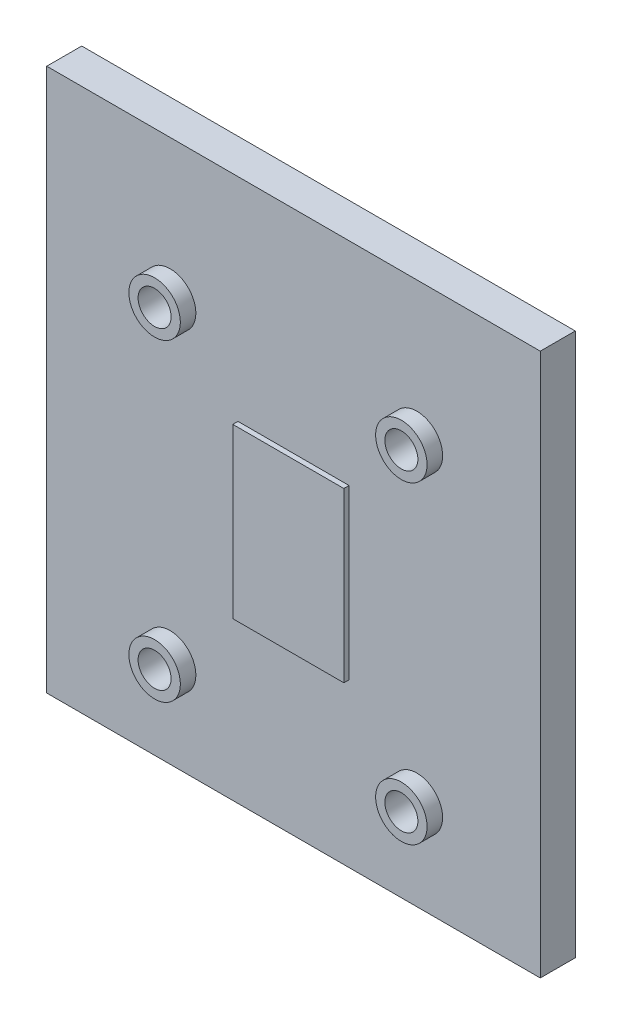
ISO-10303-21;
HEADER;
FILE_DESCRIPTION(('STEP AP214'),'2;1');
FILE_NAME('part.step','',(''),(''),'','','');
FILE_SCHEMA(('AUTOMOTIVE_DESIGN { 1 0 10303 214 1 1 1 1 }'));
ENDSEC;
DATA;
#1=APPLICATION_CONTEXT('core data for automotive mechanical design processes');
#2=APPLICATION_PROTOCOL_DEFINITION('international standard','automotive_design',2000,#1);
#3=PRODUCT_CONTEXT('',#1,'mechanical');
#4=PRODUCT('Part','Part','',(#3));
#5=PRODUCT_RELATED_PRODUCT_CATEGORY('part','',(#4));
#6=PRODUCT_DEFINITION_FORMATION('','',#4);
#7=PRODUCT_DEFINITION_CONTEXT('part definition',#1,'design');
#8=PRODUCT_DEFINITION('design','',#6,#7);
#9=PRODUCT_DEFINITION_SHAPE('','',#8);
#10=(LENGTH_UNIT() NAMED_UNIT(*) SI_UNIT(.MILLI.,.METRE.));
#11=(NAMED_UNIT(*) PLANE_ANGLE_UNIT() SI_UNIT($,.RADIAN.));
#12=(NAMED_UNIT(*) SI_UNIT($,.STERADIAN.) SOLID_ANGLE_UNIT());
#13=UNCERTAINTY_MEASURE_WITH_UNIT(LENGTH_MEASURE(1.E-05),#10,'distance_accuracy_value','');
#14=(GEOMETRIC_REPRESENTATION_CONTEXT(3) GLOBAL_UNCERTAINTY_ASSIGNED_CONTEXT((#13)) GLOBAL_UNIT_ASSIGNED_CONTEXT((#10,
#11,#12)) REPRESENTATION_CONTEXT('',''));
#15=CARTESIAN_POINT('',(0.,0.,0.));
#16=DIRECTION('',(0.,0.,1.));
#17=DIRECTION('',(1.,0.,0.));
#18=AXIS2_PLACEMENT_3D('',#15,#16,#17);
#19=CARTESIAN_POINT('',(-25.4,30.48,-3.6));
#20=DIRECTION('',(-1.,0.,0.));
#21=DIRECTION('',(0.,0.,1.));
#22=AXIS2_PLACEMENT_3D('',#19,#20,#21);
#23=PLANE('',#22);
#24=DIRECTION('',(0.,-1.,0.));
#25=VECTOR('',#24,1.);
#26=CARTESIAN_POINT('',(-25.4,30.48,0.));
#27=LINE('',#26,#25);
#28=CARTESIAN_POINT('',(-25.4,30.48,0.));
#29=VERTEX_POINT('',#28);
#30=CARTESIAN_POINT('',(-25.4,-25.4,0.));
#31=VERTEX_POINT('',#30);
#32=EDGE_CURVE('E122',#29,#31,#27,.T.);
#33=ORIENTED_EDGE('',*,*,#32,.F.);
#34=DIRECTION('',(0.,0.,1.));
#35=VECTOR('',#34,1.);
#36=CARTESIAN_POINT('',(-25.4,30.48,-3.6));
#37=LINE('',#36,#35);
#38=CARTESIAN_POINT('',(-25.4,30.48,-3.6));
#39=VERTEX_POINT('',#38);
#40=EDGE_CURVE('E152',#39,#29,#37,.T.);
#41=ORIENTED_EDGE('',*,*,#40,.F.);
#42=DIRECTION('',(0.,-1.,0.));
#43=VECTOR('',#42,1.);
#44=CARTESIAN_POINT('',(-25.4,30.48,-3.6));
#45=LINE('',#44,#43);
#46=CARTESIAN_POINT('',(-25.4,-25.4,-3.6));
#47=VERTEX_POINT('',#46);
#48=EDGE_CURVE('E131',#39,#47,#45,.T.);
#49=ORIENTED_EDGE('',*,*,#48,.T.);
#50=DIRECTION('',(0.,0.,1.));
#51=VECTOR('',#50,1.);
#52=CARTESIAN_POINT('',(-25.4,-25.4,-3.6));
#53=LINE('',#52,#51);
#54=EDGE_CURVE('E143',#47,#31,#53,.T.);
#55=ORIENTED_EDGE('',*,*,#54,.T.);
#56=EDGE_LOOP('',(#33,#41,#49,#55));
#57=FACE_BOUND('',#56,.T.);
#58=ADVANCED_FACE('F38',(#57),#23,.T.);
#59=CARTESIAN_POINT('',(25.4,30.48,-3.6));
#60=DIRECTION('',(0.,1.,0.));
#61=DIRECTION('',(-1.,0.,0.));
#62=AXIS2_PLACEMENT_3D('',#59,#60,#61);
#63=PLANE('',#62);
#64=DIRECTION('',(-1.,0.,0.));
#65=VECTOR('',#64,1.);
#66=CARTESIAN_POINT('',(25.4,30.48,0.));
#67=LINE('',#66,#65);
#68=CARTESIAN_POINT('',(25.4,30.48,0.));
#69=VERTEX_POINT('',#68);
#70=EDGE_CURVE('E135',#69,#29,#67,.T.);
#71=ORIENTED_EDGE('',*,*,#70,.F.);
#72=DIRECTION('',(0.,0.,1.));
#73=VECTOR('',#72,1.);
#74=CARTESIAN_POINT('',(25.4,30.48,-3.6));
#75=LINE('',#74,#73);
#76=CARTESIAN_POINT('',(25.4,30.48,-3.6));
#77=VERTEX_POINT('',#76);
#78=EDGE_CURVE('E155',#77,#69,#75,.T.);
#79=ORIENTED_EDGE('',*,*,#78,.F.);
#80=DIRECTION('',(-1.,0.,0.));
#81=VECTOR('',#80,1.);
#82=CARTESIAN_POINT('',(25.4,30.48,-3.6));
#83=LINE('',#82,#81);
#84=EDGE_CURVE('E141',#77,#39,#83,.T.);
#85=ORIENTED_EDGE('',*,*,#84,.T.);
#86=ORIENTED_EDGE('',*,*,#40,.T.);
#87=EDGE_LOOP('',(#71,#79,#85,#86));
#88=FACE_BOUND('',#87,.T.);
#89=ADVANCED_FACE('F192',(#88),#63,.T.);
#90=CARTESIAN_POINT('',(25.4,-25.4,-3.6));
#91=DIRECTION('',(1.,0.,0.));
#92=DIRECTION('',(0.,0.,-1.));
#93=AXIS2_PLACEMENT_3D('',#90,#91,#92);
#94=PLANE('',#93);
#95=DIRECTION('',(0.,1.,0.));
#96=VECTOR('',#95,1.);
#97=CARTESIAN_POINT('',(25.4,-25.4,0.));
#98=LINE('',#97,#96);
#99=CARTESIAN_POINT('',(25.4,-25.4,0.));
#100=VERTEX_POINT('',#99);
#101=EDGE_CURVE('E147',#100,#69,#98,.T.);
#102=ORIENTED_EDGE('',*,*,#101,.F.);
#103=DIRECTION('',(0.,0.,1.));
#104=VECTOR('',#103,1.);
#105=CARTESIAN_POINT('',(25.4,-25.4,-3.6));
#106=LINE('',#105,#104);
#107=CARTESIAN_POINT('',(25.4,-25.4,-3.6));
#108=VERTEX_POINT('',#107);
#109=EDGE_CURVE('E157',#108,#100,#106,.T.);
#110=ORIENTED_EDGE('',*,*,#109,.F.);
#111=DIRECTION('',(0.,1.,0.));
#112=VECTOR('',#111,1.);
#113=CARTESIAN_POINT('',(25.4,-25.4,-3.6));
#114=LINE('',#113,#112);
#115=EDGE_CURVE('E138',#108,#77,#114,.T.);
#116=ORIENTED_EDGE('',*,*,#115,.T.);
#117=ORIENTED_EDGE('',*,*,#78,.T.);
#118=EDGE_LOOP('',(#102,#110,#116,#117));
#119=FACE_BOUND('',#118,.T.);
#120=ADVANCED_FACE('F190',(#119),#94,.T.);
#121=CARTESIAN_POINT('',(-25.4,-25.4,-3.6));
#122=DIRECTION('',(0.,-1.,0.));
#123=DIRECTION('',(0.,0.,-1.));
#124=AXIS2_PLACEMENT_3D('',#121,#122,#123);
#125=PLANE('',#124);
#126=DIRECTION('',(1.,0.,0.));
#127=VECTOR('',#126,1.);
#128=CARTESIAN_POINT('',(-25.4,-25.4,0.));
#129=LINE('',#128,#127);
#130=EDGE_CURVE('E125',#31,#100,#129,.T.);
#131=ORIENTED_EDGE('',*,*,#130,.F.);
#132=ORIENTED_EDGE('',*,*,#54,.F.);
#133=DIRECTION('',(1.,0.,0.));
#134=VECTOR('',#133,1.);
#135=CARTESIAN_POINT('',(-25.4,-25.4,-3.6));
#136=LINE('',#135,#134);
#137=EDGE_CURVE('E134',#47,#108,#136,.T.);
#138=ORIENTED_EDGE('',*,*,#137,.T.);
#139=ORIENTED_EDGE('',*,*,#109,.T.);
#140=EDGE_LOOP('',(#131,#132,#138,#139));
#141=FACE_BOUND('',#140,.T.);
#142=ADVANCED_FACE('F186',(#141),#125,.T.);
#143=CARTESIAN_POINT('',(0.,0.,-3.6));
#144=DIRECTION('',(0.,0.,1.));
#145=DIRECTION('',(1.,0.,0.));
#146=AXIS2_PLACEMENT_3D('',#143,#144,#145);
#147=PLANE('',#146);
#148=CARTESIAN_POINT('',(-12.7,-16.129,-3.6));
#149=DIRECTION('',(0.,0.,1.));
#150=DIRECTION('',(1.,0.,0.));
#151=AXIS2_PLACEMENT_3D('',#148,#149,#150);
#152=CIRCLE('',#151,1.69999999999999);
#153=CARTESIAN_POINT('',(-11.,-16.129,-3.6));
#154=VERTEX_POINT('',#153);
#155=EDGE_CURVE('E401',#154,#154,#152,.T.);
#156=ORIENTED_EDGE('',*,*,#155,.T.);
#157=EDGE_LOOP('',(#156));
#158=FACE_BOUND('',#157,.T.);
#159=CARTESIAN_POINT('',(12.7,-16.129,-3.6));
#160=DIRECTION('',(0.,0.,1.));
#161=DIRECTION('',(1.,0.,0.));
#162=AXIS2_PLACEMENT_3D('',#159,#160,#161);
#163=CIRCLE('',#162,1.69999999999999);
#164=CARTESIAN_POINT('',(14.4,-16.129,-3.6));
#165=VERTEX_POINT('',#164);
#166=EDGE_CURVE('E411',#165,#165,#163,.T.);
#167=ORIENTED_EDGE('',*,*,#166,.T.);
#168=EDGE_LOOP('',(#167));
#169=FACE_BOUND('',#168,.T.);
#170=CARTESIAN_POINT('',(12.7,16.129,-3.6));
#171=DIRECTION('',(0.,0.,1.));
#172=DIRECTION('',(1.,0.,0.));
#173=AXIS2_PLACEMENT_3D('',#170,#171,#172);
#174=CIRCLE('',#173,1.69999999999999);
#175=CARTESIAN_POINT('',(14.4,16.129,-3.6));
#176=VERTEX_POINT('',#175);
#177=EDGE_CURVE('E417',#176,#176,#174,.T.);
#178=ORIENTED_EDGE('',*,*,#177,.T.);
#179=EDGE_LOOP('',(#178));
#180=FACE_BOUND('',#179,.T.);
#181=CARTESIAN_POINT('',(-12.7,16.129,-3.6));
#182=DIRECTION('',(0.,0.,1.));
#183=DIRECTION('',(1.,0.,0.));
#184=AXIS2_PLACEMENT_3D('',#181,#182,#183);
#185=CIRCLE('',#184,1.69999999999999);
#186=CARTESIAN_POINT('',(-11.,16.129,-3.6));
#187=VERTEX_POINT('',#186);
#188=EDGE_CURVE('E423',#187,#187,#185,.T.);
#189=ORIENTED_EDGE('',*,*,#188,.T.);
#190=EDGE_LOOP('',(#189));
#191=FACE_BOUND('',#190,.T.);
#192=ORIENTED_EDGE('',*,*,#48,.F.);
#193=ORIENTED_EDGE('',*,*,#84,.F.);
#194=ORIENTED_EDGE('',*,*,#115,.F.);
#195=ORIENTED_EDGE('',*,*,#137,.F.);
#196=EDGE_LOOP('',(#192,#193,#194,#195));
#197=FACE_BOUND('',#196,.T.);
#198=ADVANCED_FACE('F172',(#158,#169,#180,#191,#197),#147,.F.);
#199=CARTESIAN_POINT('',(0.,0.,0.));
#200=DIRECTION('',(0.,0.,1.));
#201=DIRECTION('',(1.,0.,0.));
#202=AXIS2_PLACEMENT_3D('',#199,#200,#201);
#203=PLANE('',#202);
#204=CARTESIAN_POINT('',(12.7,16.129,0.));
#205=DIRECTION('',(0.,0.,1.));
#206=DIRECTION('',(1.,0.,0.));
#207=AXIS2_PLACEMENT_3D('',#204,#205,#206);
#208=CIRCLE('',#207,2.648);
#209=CARTESIAN_POINT('',(15.348,16.129,0.));
#210=VERTEX_POINT('',#209);
#211=EDGE_CURVE('E11',#210,#210,#208,.T.);
#212=ORIENTED_EDGE('',*,*,#211,.F.);
#213=EDGE_LOOP('',(#212));
#214=FACE_BOUND('',#213,.T.);
#215=CARTESIAN_POINT('',(12.7,-16.129,0.));
#216=DIRECTION('',(0.,0.,1.));
#217=DIRECTION('',(1.,0.,0.));
#218=AXIS2_PLACEMENT_3D('',#215,#216,#217);
#219=CIRCLE('',#218,2.648);
#220=CARTESIAN_POINT('',(15.348,-16.129,0.));
#221=VERTEX_POINT('',#220);
#222=EDGE_CURVE('E45',#221,#221,#219,.T.);
#223=ORIENTED_EDGE('',*,*,#222,.F.);
#224=EDGE_LOOP('',(#223));
#225=FACE_BOUND('',#224,.T.);
#226=CARTESIAN_POINT('',(-12.7,-16.129,0.));
#227=DIRECTION('',(0.,0.,1.));
#228=DIRECTION('',(1.,0.,0.));
#229=AXIS2_PLACEMENT_3D('',#226,#227,#228);
#230=CIRCLE('',#229,2.648);
#231=CARTESIAN_POINT('',(-10.052,-16.129,0.));
#232=VERTEX_POINT('',#231);
#233=EDGE_CURVE('E162',#232,#232,#230,.T.);
#234=ORIENTED_EDGE('',*,*,#233,.F.);
#235=EDGE_LOOP('',(#234));
#236=FACE_BOUND('',#235,.T.);
#237=CARTESIAN_POINT('',(-12.7,16.129,0.));
#238=DIRECTION('',(0.,0.,1.));
#239=DIRECTION('',(1.,0.,0.));
#240=AXIS2_PLACEMENT_3D('',#237,#238,#239);
#241=CIRCLE('',#240,2.648);
#242=CARTESIAN_POINT('',(-10.052,16.129,0.));
#243=VERTEX_POINT('',#242);
#244=EDGE_CURVE('E154',#243,#243,#241,.T.);
#245=ORIENTED_EDGE('',*,*,#244,.F.);
#246=EDGE_LOOP('',(#245));
#247=FACE_BOUND('',#246,.T.);
#248=DIRECTION('',(0.,-1.,0.));
#249=VECTOR('',#248,1.);
#250=CARTESIAN_POINT('',(-5.715,-8.6614,0.));
#251=LINE('',#250,#249);
#252=CARTESIAN_POINT('',(-5.715,8.6614,0.));
#253=VERTEX_POINT('',#252);
#254=CARTESIAN_POINT('',(-5.715,-8.6614,0.));
#255=VERTEX_POINT('',#254);
#256=EDGE_CURVE('E52',#253,#255,#251,.T.);
#257=ORIENTED_EDGE('',*,*,#256,.F.);
#258=DIRECTION('',(-1.,0.,0.));
#259=VECTOR('',#258,1.);
#260=CARTESIAN_POINT('',(-5.715,8.6614,0.));
#261=LINE('',#260,#259);
#262=CARTESIAN_POINT('',(5.715,8.6614,0.));
#263=VERTEX_POINT('',#262);
#264=EDGE_CURVE('E56',#263,#253,#261,.T.);
#265=ORIENTED_EDGE('',*,*,#264,.F.);
#266=DIRECTION('',(0.,1.,0.));
#267=VECTOR('',#266,1.);
#268=CARTESIAN_POINT('',(5.715,8.6614,0.));
#269=LINE('',#268,#267);
#270=CARTESIAN_POINT('',(5.715,-8.6614,0.));
#271=VERTEX_POINT('',#270);
#272=EDGE_CURVE('E444',#271,#263,#269,.T.);
#273=ORIENTED_EDGE('',*,*,#272,.F.);
#274=DIRECTION('',(1.,0.,0.));
#275=VECTOR('',#274,1.);
#276=CARTESIAN_POINT('',(5.715,-8.6614,0.));
#277=LINE('',#276,#275);
#278=EDGE_CURVE('E442',#255,#271,#277,.T.);
#279=ORIENTED_EDGE('',*,*,#278,.F.);
#280=EDGE_LOOP('',(#257,#265,#273,#279));
#281=FACE_BOUND('',#280,.T.);
#282=ORIENTED_EDGE('',*,*,#32,.T.);
#283=ORIENTED_EDGE('',*,*,#130,.T.);
#284=ORIENTED_EDGE('',*,*,#101,.T.);
#285=ORIENTED_EDGE('',*,*,#70,.T.);
#286=EDGE_LOOP('',(#282,#283,#284,#285));
#287=FACE_BOUND('',#286,.T.);
#288=ADVANCED_FACE('F169',(#214,#225,#236,#247,#281,#287),#203,.T.);
#289=CARTESIAN_POINT('',(-5.715,-8.6614,0.5332));
#290=DIRECTION('',(1.,0.,0.));
#291=DIRECTION('',(0.,1.,0.));
#292=AXIS2_PLACEMENT_3D('',#289,#290,#291);
#293=PLANE('',#292);
#294=ORIENTED_EDGE('',*,*,#256,.T.);
#295=DIRECTION('',(0.,0.,-1.));
#296=VECTOR('',#295,1.);
#297=CARTESIAN_POINT('',(-5.715,-8.6614,0.5332));
#298=LINE('',#297,#296);
#299=CARTESIAN_POINT('',(-5.715,-8.6614,0.5332));
#300=VERTEX_POINT('',#299);
#301=EDGE_CURVE('E105',#300,#255,#298,.T.);
#302=ORIENTED_EDGE('',*,*,#301,.F.);
#303=DIRECTION('',(0.,-1.,0.));
#304=VECTOR('',#303,1.);
#305=CARTESIAN_POINT('',(-5.715,-8.6614,0.5332));
#306=LINE('',#305,#304);
#307=CARTESIAN_POINT('',(-5.715,8.6614,0.5332));
#308=VERTEX_POINT('',#307);
#309=EDGE_CURVE('E111',#308,#300,#306,.T.);
#310=ORIENTED_EDGE('',*,*,#309,.F.);
#311=DIRECTION('',(0.,0.,-1.));
#312=VECTOR('',#311,1.);
#313=CARTESIAN_POINT('',(-5.715,8.6614,0.5332));
#314=LINE('',#313,#312);
#315=EDGE_CURVE('E440',#308,#253,#314,.T.);
#316=ORIENTED_EDGE('',*,*,#315,.T.);
#317=EDGE_LOOP('',(#294,#302,#310,#316));
#318=FACE_BOUND('',#317,.T.);
#319=ADVANCED_FACE('F121',(#318),#293,.F.);
#320=CARTESIAN_POINT('',(5.715,-8.6614,0.5332));
#321=DIRECTION('',(0.,1.,0.));
#322=DIRECTION('',(0.,0.,1.));
#323=AXIS2_PLACEMENT_3D('',#320,#321,#322);
#324=PLANE('',#323);
#325=ORIENTED_EDGE('',*,*,#278,.T.);
#326=DIRECTION('',(0.,0.,-1.));
#327=VECTOR('',#326,1.);
#328=CARTESIAN_POINT('',(5.715,-8.6614,0.5332));
#329=LINE('',#328,#327);
#330=CARTESIAN_POINT('',(5.715,-8.6614,0.5332));
#331=VERTEX_POINT('',#330);
#332=EDGE_CURVE('E107',#331,#271,#329,.T.);
#333=ORIENTED_EDGE('',*,*,#332,.F.);
#334=DIRECTION('',(1.,0.,0.));
#335=VECTOR('',#334,1.);
#336=CARTESIAN_POINT('',(5.715,-8.6614,0.5332));
#337=LINE('',#336,#335);
#338=EDGE_CURVE('E100',#300,#331,#337,.T.);
#339=ORIENTED_EDGE('',*,*,#338,.F.);
#340=ORIENTED_EDGE('',*,*,#301,.T.);
#341=EDGE_LOOP('',(#325,#333,#339,#340));
#342=FACE_BOUND('',#341,.T.);
#343=ADVANCED_FACE('F103',(#342),#324,.F.);
#344=CARTESIAN_POINT('',(5.715,8.6614,0.5332));
#345=DIRECTION('',(-1.,0.,0.));
#346=DIRECTION('',(0.,-1.,0.));
#347=AXIS2_PLACEMENT_3D('',#344,#345,#346);
#348=PLANE('',#347);
#349=ORIENTED_EDGE('',*,*,#272,.T.);
#350=DIRECTION('',(0.,0.,-1.));
#351=VECTOR('',#350,1.);
#352=CARTESIAN_POINT('',(5.715,8.6614,0.5332));
#353=LINE('',#352,#351);
#354=CARTESIAN_POINT('',(5.715,8.6614,0.5332));
#355=VERTEX_POINT('',#354);
#356=EDGE_CURVE('E127',#355,#263,#353,.T.);
#357=ORIENTED_EDGE('',*,*,#356,.F.);
#358=DIRECTION('',(0.,1.,0.));
#359=VECTOR('',#358,1.);
#360=CARTESIAN_POINT('',(5.715,8.6614,0.5332));
#361=LINE('',#360,#359);
#362=EDGE_CURVE('E110',#331,#355,#361,.T.);
#363=ORIENTED_EDGE('',*,*,#362,.F.);
#364=ORIENTED_EDGE('',*,*,#332,.T.);
#365=EDGE_LOOP('',(#349,#357,#363,#364));
#366=FACE_BOUND('',#365,.T.);
#367=ADVANCED_FACE('F237',(#366),#348,.F.);
#368=CARTESIAN_POINT('',(-5.715,8.6614,0.5332));
#369=DIRECTION('',(0.,-1.,0.));
#370=DIRECTION('',(0.,0.,-1.));
#371=AXIS2_PLACEMENT_3D('',#368,#369,#370);
#372=PLANE('',#371);
#373=ORIENTED_EDGE('',*,*,#264,.T.);
#374=ORIENTED_EDGE('',*,*,#315,.F.);
#375=DIRECTION('',(-1.,0.,0.));
#376=VECTOR('',#375,1.);
#377=CARTESIAN_POINT('',(-5.715,8.6614,0.5332));
#378=LINE('',#377,#376);
#379=EDGE_CURVE('E116',#355,#308,#378,.T.);
#380=ORIENTED_EDGE('',*,*,#379,.F.);
#381=ORIENTED_EDGE('',*,*,#356,.T.);
#382=EDGE_LOOP('',(#373,#374,#380,#381));
#383=FACE_BOUND('',#382,.T.);
#384=ADVANCED_FACE('F246',(#383),#372,.F.);
#385=CARTESIAN_POINT('',(0.,0.,0.5332));
#386=DIRECTION('',(0.,0.,-1.));
#387=DIRECTION('',(-1.,0.,0.));
#388=AXIS2_PLACEMENT_3D('',#385,#386,#387);
#389=PLANE('',#388);
#390=ORIENTED_EDGE('',*,*,#309,.T.);
#391=ORIENTED_EDGE('',*,*,#338,.T.);
#392=ORIENTED_EDGE('',*,*,#362,.T.);
#393=ORIENTED_EDGE('',*,*,#379,.T.);
#394=EDGE_LOOP('',(#390,#391,#392,#393));
#395=FACE_BOUND('',#394,.T.);
#396=ADVANCED_FACE('F114',(#395),#389,.F.);
#397=CARTESIAN_POINT('',(-12.7,16.129,1.6));
#398=DIRECTION('',(0.,0.,-1.));
#399=DIRECTION('',(-1.,0.,0.));
#400=AXIS2_PLACEMENT_3D('',#397,#398,#399);
#401=CYLINDRICAL_SURFACE('',#400,2.648);
#402=CARTESIAN_POINT('',(-12.7,16.129,1.6));
#403=DIRECTION('',(0.,0.,-1.));
#404=DIRECTION('',(-1.,0.,0.));
#405=AXIS2_PLACEMENT_3D('',#402,#403,#404);
#406=CIRCLE('',#405,2.648);
#407=CARTESIAN_POINT('',(-15.348,16.129,1.6));
#408=VERTEX_POINT('',#407);
#409=EDGE_CURVE('E435',#408,#408,#406,.T.);
#410=ORIENTED_EDGE('',*,*,#409,.T.);
#411=EDGE_LOOP('',(#410));
#412=FACE_BOUND('',#411,.T.);
#413=ORIENTED_EDGE('',*,*,#244,.T.);
#414=EDGE_LOOP('',(#413));
#415=FACE_BOUND('',#414,.T.);
#416=ADVANCED_FACE('F265',(#412,#415),#401,.T.);
#417=CARTESIAN_POINT('',(-10.052,16.129,1.6));
#418=DIRECTION('',(0.,0.,1.));
#419=DIRECTION('',(1.,0.,0.));
#420=AXIS2_PLACEMENT_3D('',#417,#418,#419);
#421=PLANE('',#420);
#422=CARTESIAN_POINT('',(-12.7,16.129,1.6));
#423=DIRECTION('',(0.,0.,1.));
#424=DIRECTION('',(1.,0.,0.));
#425=AXIS2_PLACEMENT_3D('',#422,#423,#424);
#426=CIRCLE('',#425,1.69999999999999);
#427=CARTESIAN_POINT('',(-11.,16.129,1.6));
#428=VERTEX_POINT('',#427);
#429=EDGE_CURVE('E420',#428,#428,#426,.T.);
#430=ORIENTED_EDGE('',*,*,#429,.F.);
#431=EDGE_LOOP('',(#430));
#432=FACE_BOUND('',#431,.T.);
#433=ORIENTED_EDGE('',*,*,#409,.F.);
#434=EDGE_LOOP('',(#433));
#435=FACE_BOUND('',#434,.T.);
#436=ADVANCED_FACE('F274',(#432,#435),#421,.T.);
#437=CARTESIAN_POINT('',(-12.7,-16.129,1.6));
#438=DIRECTION('',(0.,0.,-1.));
#439=DIRECTION('',(-1.,0.,0.));
#440=AXIS2_PLACEMENT_3D('',#437,#438,#439);
#441=CYLINDRICAL_SURFACE('',#440,2.648);
#442=CARTESIAN_POINT('',(-12.7,-16.129,1.6));
#443=DIRECTION('',(0.,0.,-1.));
#444=DIRECTION('',(-1.,0.,0.));
#445=AXIS2_PLACEMENT_3D('',#442,#443,#444);
#446=CIRCLE('',#445,2.648);
#447=CARTESIAN_POINT('',(-15.348,-16.129,1.6));
#448=VERTEX_POINT('',#447);
#449=EDGE_CURVE('E432',#448,#448,#446,.T.);
#450=ORIENTED_EDGE('',*,*,#449,.T.);
#451=EDGE_LOOP('',(#450));
#452=FACE_BOUND('',#451,.T.);
#453=ORIENTED_EDGE('',*,*,#233,.T.);
#454=EDGE_LOOP('',(#453));
#455=FACE_BOUND('',#454,.T.);
#456=ADVANCED_FACE('F282',(#452,#455),#441,.T.);
#457=CARTESIAN_POINT('',(-10.052,-16.129,1.6));
#458=DIRECTION('',(0.,0.,1.));
#459=DIRECTION('',(1.,0.,0.));
#460=AXIS2_PLACEMENT_3D('',#457,#458,#459);
#461=PLANE('',#460);
#462=CARTESIAN_POINT('',(-12.7,-16.129,1.6));
#463=DIRECTION('',(0.,0.,1.));
#464=DIRECTION('',(1.,0.,0.));
#465=AXIS2_PLACEMENT_3D('',#462,#463,#464);
#466=CIRCLE('',#465,1.69999999999999);
#467=CARTESIAN_POINT('',(-11.,-16.129,1.6));
#468=VERTEX_POINT('',#467);
#469=EDGE_CURVE('E404',#468,#468,#466,.T.);
#470=ORIENTED_EDGE('',*,*,#469,.F.);
#471=EDGE_LOOP('',(#470));
#472=FACE_BOUND('',#471,.T.);
#473=ORIENTED_EDGE('',*,*,#449,.F.);
#474=EDGE_LOOP('',(#473));
#475=FACE_BOUND('',#474,.T.);
#476=ADVANCED_FACE('F287',(#472,#475),#461,.T.);
#477=CARTESIAN_POINT('',(12.7,-16.129,1.6));
#478=DIRECTION('',(0.,0.,-1.));
#479=DIRECTION('',(-1.,0.,0.));
#480=AXIS2_PLACEMENT_3D('',#477,#478,#479);
#481=CYLINDRICAL_SURFACE('',#480,2.648);
#482=CARTESIAN_POINT('',(12.7,-16.129,1.6));
#483=DIRECTION('',(0.,0.,-1.));
#484=DIRECTION('',(-1.,0.,0.));
#485=AXIS2_PLACEMENT_3D('',#482,#483,#484);
#486=CIRCLE('',#485,2.648);
#487=CARTESIAN_POINT('',(10.052,-16.129,1.6));
#488=VERTEX_POINT('',#487);
#489=EDGE_CURVE('E429',#488,#488,#486,.T.);
#490=ORIENTED_EDGE('',*,*,#489,.T.);
#491=EDGE_LOOP('',(#490));
#492=FACE_BOUND('',#491,.T.);
#493=ORIENTED_EDGE('',*,*,#222,.T.);
#494=EDGE_LOOP('',(#493));
#495=FACE_BOUND('',#494,.T.);
#496=ADVANCED_FACE('F167',(#492,#495),#481,.T.);
#497=CARTESIAN_POINT('',(15.348,-16.129,1.6));
#498=DIRECTION('',(0.,0.,1.));
#499=DIRECTION('',(1.,0.,0.));
#500=AXIS2_PLACEMENT_3D('',#497,#498,#499);
#501=PLANE('',#500);
#502=CARTESIAN_POINT('',(12.7,-16.129,1.6));
#503=DIRECTION('',(0.,0.,1.));
#504=DIRECTION('',(1.,0.,0.));
#505=AXIS2_PLACEMENT_3D('',#502,#503,#504);
#506=CIRCLE('',#505,1.69999999999999);
#507=CARTESIAN_POINT('',(14.4,-16.129,1.6));
#508=VERTEX_POINT('',#507);
#509=EDGE_CURVE('E406',#508,#508,#506,.T.);
#510=ORIENTED_EDGE('',*,*,#509,.F.);
#511=EDGE_LOOP('',(#510));
#512=FACE_BOUND('',#511,.T.);
#513=ORIENTED_EDGE('',*,*,#489,.F.);
#514=EDGE_LOOP('',(#513));
#515=FACE_BOUND('',#514,.T.);
#516=ADVANCED_FACE('F299',(#512,#515),#501,.T.);
#517=CARTESIAN_POINT('',(12.7,16.129,1.6));
#518=DIRECTION('',(0.,0.,-1.));
#519=DIRECTION('',(-1.,0.,0.));
#520=AXIS2_PLACEMENT_3D('',#517,#518,#519);
#521=CYLINDRICAL_SURFACE('',#520,2.648);
#522=CARTESIAN_POINT('',(12.7,16.129,1.6));
#523=DIRECTION('',(0.,0.,-1.));
#524=DIRECTION('',(-1.,0.,0.));
#525=AXIS2_PLACEMENT_3D('',#522,#523,#524);
#526=CIRCLE('',#525,2.648);
#527=CARTESIAN_POINT('',(10.052,16.129,1.6));
#528=VERTEX_POINT('',#527);
#529=EDGE_CURVE('E426',#528,#528,#526,.T.);
#530=ORIENTED_EDGE('',*,*,#529,.T.);
#531=EDGE_LOOP('',(#530));
#532=FACE_BOUND('',#531,.T.);
#533=ORIENTED_EDGE('',*,*,#211,.T.);
#534=EDGE_LOOP('',(#533));
#535=FACE_BOUND('',#534,.T.);
#536=ADVANCED_FACE('F312',(#532,#535),#521,.T.);
#537=CARTESIAN_POINT('',(15.348,16.129,1.6));
#538=DIRECTION('',(0.,0.,1.));
#539=DIRECTION('',(1.,0.,0.));
#540=AXIS2_PLACEMENT_3D('',#537,#538,#539);
#541=PLANE('',#540);
#542=CARTESIAN_POINT('',(12.7,16.129,1.6));
#543=DIRECTION('',(0.,0.,1.));
#544=DIRECTION('',(1.,0.,0.));
#545=AXIS2_PLACEMENT_3D('',#542,#543,#544);
#546=CIRCLE('',#545,1.69999999999999);
#547=CARTESIAN_POINT('',(14.4,16.129,1.6));
#548=VERTEX_POINT('',#547);
#549=EDGE_CURVE('E414',#548,#548,#546,.T.);
#550=ORIENTED_EDGE('',*,*,#549,.F.);
#551=EDGE_LOOP('',(#550));
#552=FACE_BOUND('',#551,.T.);
#553=ORIENTED_EDGE('',*,*,#529,.F.);
#554=EDGE_LOOP('',(#553));
#555=FACE_BOUND('',#554,.T.);
#556=ADVANCED_FACE('F316',(#552,#555),#541,.T.);
#557=CARTESIAN_POINT('',(-12.7,16.129,1.6));
#558=DIRECTION('',(0.,0.,1.));
#559=DIRECTION('',(1.,0.,0.));
#560=AXIS2_PLACEMENT_3D('',#557,#558,#559);
#561=CYLINDRICAL_SURFACE('',#560,1.69999999999999);
#562=ORIENTED_EDGE('',*,*,#188,.F.);
#563=EDGE_LOOP('',(#562));
#564=FACE_BOUND('',#563,.T.);
#565=ORIENTED_EDGE('',*,*,#429,.T.);
#566=EDGE_LOOP('',(#565));
#567=FACE_BOUND('',#566,.T.);
#568=ADVANCED_FACE('F351',(#564,#567),#561,.F.);
#569=CARTESIAN_POINT('',(12.7,16.129,1.6));
#570=DIRECTION('',(0.,0.,1.));
#571=DIRECTION('',(1.,0.,0.));
#572=AXIS2_PLACEMENT_3D('',#569,#570,#571);
#573=CYLINDRICAL_SURFACE('',#572,1.69999999999999);
#574=ORIENTED_EDGE('',*,*,#177,.F.);
#575=EDGE_LOOP('',(#574));
#576=FACE_BOUND('',#575,.T.);
#577=ORIENTED_EDGE('',*,*,#549,.T.);
#578=EDGE_LOOP('',(#577));
#579=FACE_BOUND('',#578,.T.);
#580=ADVANCED_FACE('F362',(#576,#579),#573,.F.);
#581=CARTESIAN_POINT('',(12.7,-16.129,1.6));
#582=DIRECTION('',(0.,0.,1.));
#583=DIRECTION('',(1.,0.,0.));
#584=AXIS2_PLACEMENT_3D('',#581,#582,#583);
#585=CYLINDRICAL_SURFACE('',#584,1.69999999999999);
#586=ORIENTED_EDGE('',*,*,#166,.F.);
#587=EDGE_LOOP('',(#586));
#588=FACE_BOUND('',#587,.T.);
#589=ORIENTED_EDGE('',*,*,#509,.T.);
#590=EDGE_LOOP('',(#589));
#591=FACE_BOUND('',#590,.T.);
#592=ADVANCED_FACE('F372',(#588,#591),#585,.F.);
#593=CARTESIAN_POINT('',(-12.7,-16.129,1.6));
#594=DIRECTION('',(0.,0.,1.));
#595=DIRECTION('',(1.,0.,0.));
#596=AXIS2_PLACEMENT_3D('',#593,#594,#595);
#597=CYLINDRICAL_SURFACE('',#596,1.69999999999999);
#598=ORIENTED_EDGE('',*,*,#155,.F.);
#599=EDGE_LOOP('',(#598));
#600=FACE_BOUND('',#599,.T.);
#601=ORIENTED_EDGE('',*,*,#469,.T.);
#602=EDGE_LOOP('',(#601));
#603=FACE_BOUND('',#602,.T.);
#604=ADVANCED_FACE('F382',(#600,#603),#597,.F.);
#605=CLOSED_SHELL('',(#58,#89,#120,#142,#198,#288,#319,#343,#367,#384,#396,#416,#436,#456,#476,
#496,#516,#536,#556,#568,#580,#592,#604));
#606=MANIFOLD_SOLID_BREP('B2',#605);
#607=ADVANCED_BREP_SHAPE_REPRESENTATION('',(#18,#606),#14);
#608=SHAPE_DEFINITION_REPRESENTATION(#9,#607);
ENDSEC;
END-ISO-10303-21;
